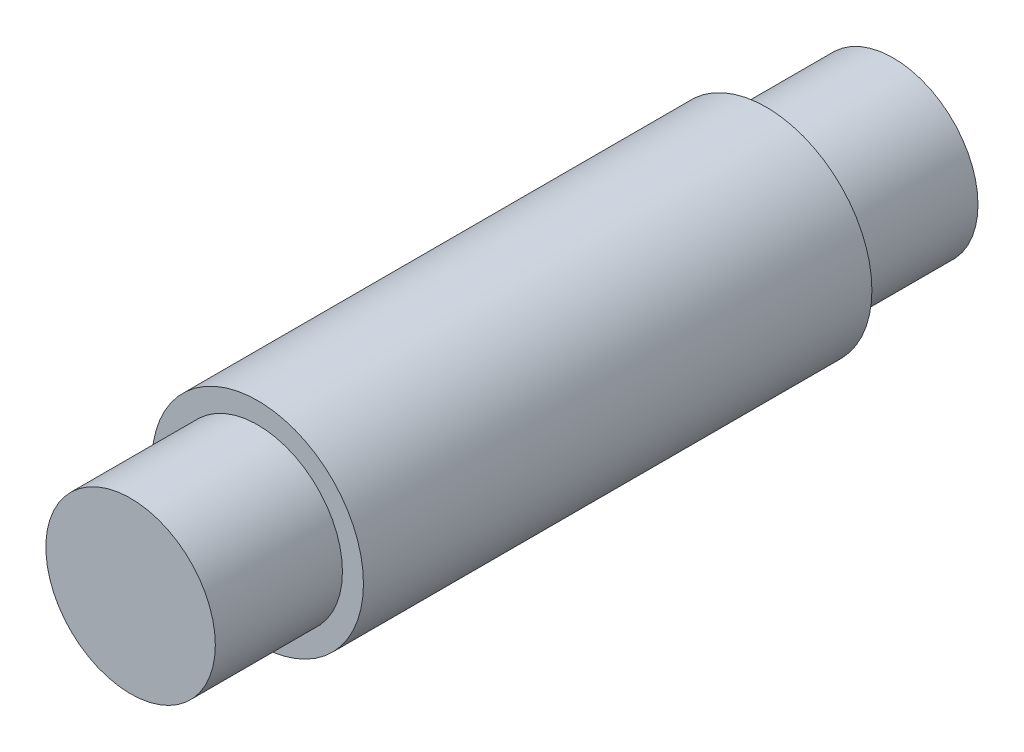
ISO-10303-21;
HEADER;
FILE_DESCRIPTION(('STEP AP214'),'2;1');
FILE_NAME('part.step','',(''),(''),'','','');
FILE_SCHEMA(('AUTOMOTIVE_DESIGN { 1 0 10303 214 1 1 1 1 }'));
ENDSEC;
DATA;
#1=APPLICATION_CONTEXT('core data for automotive mechanical design processes');
#2=APPLICATION_PROTOCOL_DEFINITION('international standard','automotive_design',2000,#1);
#3=PRODUCT_CONTEXT('',#1,'mechanical');
#4=PRODUCT('Part','Part','',(#3));
#5=PRODUCT_RELATED_PRODUCT_CATEGORY('part','',(#4));
#6=PRODUCT_DEFINITION_FORMATION('','',#4);
#7=PRODUCT_DEFINITION_CONTEXT('part definition',#1,'design');
#8=PRODUCT_DEFINITION('design','',#6,#7);
#9=PRODUCT_DEFINITION_SHAPE('','',#8);
#10=(LENGTH_UNIT() NAMED_UNIT(*) SI_UNIT(.MILLI.,.METRE.));
#11=(NAMED_UNIT(*) PLANE_ANGLE_UNIT() SI_UNIT($,.RADIAN.));
#12=(NAMED_UNIT(*) SI_UNIT($,.STERADIAN.) SOLID_ANGLE_UNIT());
#13=UNCERTAINTY_MEASURE_WITH_UNIT(LENGTH_MEASURE(1.E-05),#10,'distance_accuracy_value','');
#14=(GEOMETRIC_REPRESENTATION_CONTEXT(3) GLOBAL_UNCERTAINTY_ASSIGNED_CONTEXT((#13)) GLOBAL_UNIT_ASSIGNED_CONTEXT((#10,
#11,#12)) REPRESENTATION_CONTEXT('',''));
#15=CARTESIAN_POINT('',(0.,0.,0.));
#16=DIRECTION('',(0.,0.,1.));
#17=DIRECTION('',(1.,0.,0.));
#18=AXIS2_PLACEMENT_3D('',#15,#16,#17);
#19=CARTESIAN_POINT('',(0.,0.,9.525));
#20=DIRECTION('',(0.,0.,-1.));
#21=DIRECTION('',(-1.,0.,0.));
#22=AXIS2_PLACEMENT_3D('',#19,#20,#21);
#23=CYLINDRICAL_SURFACE('',#22,3.9624);
#24=CARTESIAN_POINT('',(0.,0.,9.525));
#25=DIRECTION('',(0.,0.,1.));
#26=DIRECTION('',(1.,0.,0.));
#27=AXIS2_PLACEMENT_3D('',#24,#25,#26);
#28=CIRCLE('',#27,3.9624);
#29=CARTESIAN_POINT('',(3.9624,0.,9.525));
#30=VERTEX_POINT('',#29);
#31=EDGE_CURVE('E44',#30,#30,#28,.T.);
#32=ORIENTED_EDGE('',*,*,#31,.F.);
#33=EDGE_LOOP('',(#32));
#34=FACE_BOUND('',#33,.T.);
#35=CARTESIAN_POINT('',(0.,0.,-9.525));
#36=DIRECTION('',(0.,0.,1.));
#37=DIRECTION('',(1.,0.,0.));
#38=AXIS2_PLACEMENT_3D('',#35,#36,#37);
#39=CIRCLE('',#38,3.9624);
#40=CARTESIAN_POINT('',(3.9624,0.,-9.525));
#41=VERTEX_POINT('',#40);
#42=EDGE_CURVE('E49',#41,#41,#39,.T.);
#43=ORIENTED_EDGE('',*,*,#42,.T.);
#44=EDGE_LOOP('',(#43));
#45=FACE_BOUND('',#44,.T.);
#46=ADVANCED_FACE('F37',(#34,#45),#23,.T.);
#47=CARTESIAN_POINT('',(0.,0.,9.525));
#48=DIRECTION('',(0.,0.,1.));
#49=DIRECTION('',(1.,0.,0.));
#50=AXIS2_PLACEMENT_3D('',#47,#48,#49);
#51=PLANE('',#50);
#52=CARTESIAN_POINT('',(0.,0.,9.525));
#53=DIRECTION('',(0.,0.,1.));
#54=DIRECTION('',(1.,0.,0.));
#55=AXIS2_PLACEMENT_3D('',#52,#53,#54);
#56=CIRCLE('',#55,3.175);
#57=CARTESIAN_POINT('',(3.175,0.,9.525));
#58=VERTEX_POINT('',#57);
#59=EDGE_CURVE('E55',#58,#58,#56,.F.);
#60=ORIENTED_EDGE('',*,*,#59,.T.);
#61=EDGE_LOOP('',(#60));
#62=FACE_BOUND('',#61,.T.);
#63=ORIENTED_EDGE('',*,*,#31,.T.);
#64=EDGE_LOOP('',(#63));
#65=FACE_BOUND('',#64,.T.);
#66=ADVANCED_FACE('F87',(#62,#65),#51,.T.);
#67=CARTESIAN_POINT('',(0.,0.,-9.525));
#68=DIRECTION('',(0.,0.,1.));
#69=DIRECTION('',(1.,0.,0.));
#70=AXIS2_PLACEMENT_3D('',#67,#68,#69);
#71=PLANE('',#70);
#72=CARTESIAN_POINT('',(0.,0.,-9.525));
#73=DIRECTION('',(0.,0.,1.));
#74=DIRECTION('',(1.,0.,0.));
#75=AXIS2_PLACEMENT_3D('',#72,#73,#74);
#76=CIRCLE('',#75,3.175);
#77=CARTESIAN_POINT('',(3.175,0.,-9.525));
#78=VERTEX_POINT('',#77);
#79=EDGE_CURVE('E10',#78,#78,#76,.F.);
#80=ORIENTED_EDGE('',*,*,#79,.F.);
#81=EDGE_LOOP('',(#80));
#82=FACE_BOUND('',#81,.T.);
#83=ORIENTED_EDGE('',*,*,#42,.F.);
#84=EDGE_LOOP('',(#83));
#85=FACE_BOUND('',#84,.T.);
#86=ADVANCED_FACE('F92',(#82,#85),#71,.F.);
#87=CARTESIAN_POINT('',(0.,0.,-14.2875));
#88=DIRECTION('',(0.,0.,1.));
#89=DIRECTION('',(1.,0.,0.));
#90=AXIS2_PLACEMENT_3D('',#87,#88,#89);
#91=PLANE('',#90);
#92=CARTESIAN_POINT('',(0.,0.,-14.2875));
#93=DIRECTION('',(0.,0.,1.));
#94=DIRECTION('',(1.,0.,0.));
#95=AXIS2_PLACEMENT_3D('',#92,#93,#94);
#96=CIRCLE('',#95,3.175);
#97=CARTESIAN_POINT('',(3.175,0.,-14.2875));
#98=VERTEX_POINT('',#97);
#99=EDGE_CURVE('E61',#98,#98,#96,.T.);
#100=ORIENTED_EDGE('',*,*,#99,.F.);
#101=EDGE_LOOP('',(#100));
#102=FACE_BOUND('',#101,.T.);
#103=ADVANCED_FACE('F81',(#102),#91,.F.);
#104=CARTESIAN_POINT('',(0.,0.,14.2875));
#105=DIRECTION('',(0.,0.,-1.));
#106=DIRECTION('',(-1.,0.,0.));
#107=AXIS2_PLACEMENT_3D('',#104,#105,#106);
#108=CYLINDRICAL_SURFACE('',#107,3.175);
#109=ORIENTED_EDGE('',*,*,#99,.T.);
#110=EDGE_LOOP('',(#109));
#111=FACE_BOUND('',#110,.T.);
#112=ORIENTED_EDGE('',*,*,#79,.T.);
#113=EDGE_LOOP('',(#112));
#114=FACE_BOUND('',#113,.T.);
#115=ADVANCED_FACE('F73',(#111,#114),#108,.T.);
#116=ORIENTED_EDGE('',*,*,#59,.F.);
#117=EDGE_LOOP('',(#116));
#118=FACE_BOUND('',#117,.T.);
#119=CARTESIAN_POINT('',(0.,0.,14.2875));
#120=DIRECTION('',(0.,0.,1.));
#121=DIRECTION('',(1.,0.,0.));
#122=AXIS2_PLACEMENT_3D('',#119,#120,#121);
#123=CIRCLE('',#122,3.175);
#124=CARTESIAN_POINT('',(3.175,0.,14.2875));
#125=VERTEX_POINT('',#124);
#126=EDGE_CURVE('E60',#125,#125,#123,.T.);
#127=ORIENTED_EDGE('',*,*,#126,.F.);
#128=EDGE_LOOP('',(#127));
#129=FACE_BOUND('',#128,.T.);
#130=ADVANCED_FACE('F71',(#118,#129),#108,.T.);
#131=CARTESIAN_POINT('',(0.,0.,14.2875));
#132=DIRECTION('',(0.,0.,1.));
#133=DIRECTION('',(1.,0.,0.));
#134=AXIS2_PLACEMENT_3D('',#131,#132,#133);
#135=PLANE('',#134);
#136=ORIENTED_EDGE('',*,*,#126,.T.);
#137=EDGE_LOOP('',(#136));
#138=FACE_BOUND('',#137,.T.);
#139=ADVANCED_FACE('F69',(#138),#135,.T.);
#140=CLOSED_SHELL('',(#46,#66,#86,#103,#115,#130,#139));
#141=MANIFOLD_SOLID_BREP('B2',#140);
#142=ADVANCED_BREP_SHAPE_REPRESENTATION('',(#18,#141),#14);
#143=SHAPE_DEFINITION_REPRESENTATION(#9,#142);
ENDSEC;
END-ISO-10303-21;
